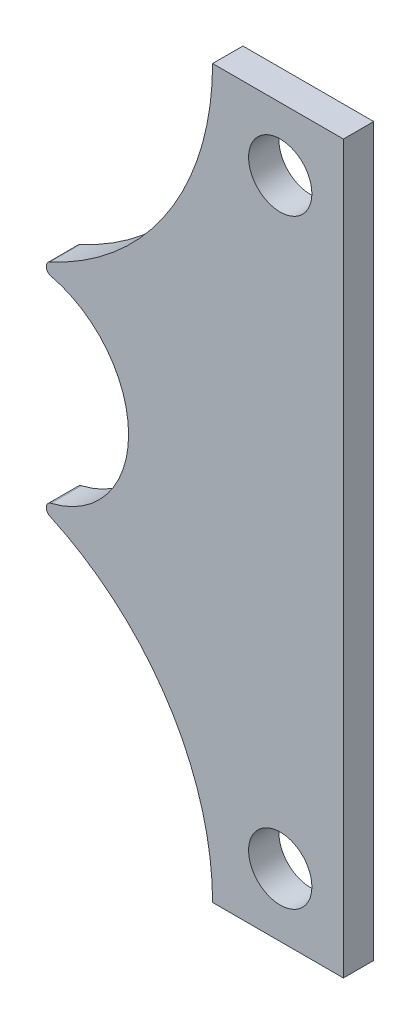
ISO-10303-21;
HEADER;
FILE_DESCRIPTION(('STEP AP214'),'2;1');
FILE_NAME('part.step','',(''),(''),'','','');
FILE_SCHEMA(('AUTOMOTIVE_DESIGN { 1 0 10303 214 1 1 1 1 }'));
ENDSEC;
DATA;
#1=APPLICATION_CONTEXT('core data for automotive mechanical design processes');
#2=APPLICATION_PROTOCOL_DEFINITION('international standard','automotive_design',2000,#1);
#3=PRODUCT_CONTEXT('',#1,'mechanical');
#4=PRODUCT('Part','Part','',(#3));
#5=PRODUCT_RELATED_PRODUCT_CATEGORY('part','',(#4));
#6=PRODUCT_DEFINITION_FORMATION('','',#4);
#7=PRODUCT_DEFINITION_CONTEXT('part definition',#1,'design');
#8=PRODUCT_DEFINITION('design','',#6,#7);
#9=PRODUCT_DEFINITION_SHAPE('','',#8);
#10=(LENGTH_UNIT() NAMED_UNIT(*) SI_UNIT(.MILLI.,.METRE.));
#11=(NAMED_UNIT(*) PLANE_ANGLE_UNIT() SI_UNIT($,.RADIAN.));
#12=(NAMED_UNIT(*) SI_UNIT($,.STERADIAN.) SOLID_ANGLE_UNIT());
#13=UNCERTAINTY_MEASURE_WITH_UNIT(LENGTH_MEASURE(1.E-05),#10,'distance_accuracy_value','');
#14=(GEOMETRIC_REPRESENTATION_CONTEXT(3) GLOBAL_UNCERTAINTY_ASSIGNED_CONTEXT((#13)) GLOBAL_UNIT_ASSIGNED_CONTEXT((#10,
#11,#12)) REPRESENTATION_CONTEXT('',''));
#15=CARTESIAN_POINT('',(0.,0.,0.));
#16=DIRECTION('',(0.,0.,1.));
#17=DIRECTION('',(1.,0.,0.));
#18=AXIS2_PLACEMENT_3D('',#15,#16,#17);
#19=CARTESIAN_POINT('',(-63.1804076074481,-73.025,3.048));
#20=DIRECTION('',(0.,0.,-1.));
#21=DIRECTION('',(-1.,0.,0.));
#22=AXIS2_PLACEMENT_3D('',#19,#20,#21);
#23=CYLINDRICAL_SURFACE('',#22,55.9342935428807);
#24=CARTESIAN_POINT('',(-63.1804076074481,-73.025,3.048));
#25=DIRECTION('',(0.,0.,1.));
#26=DIRECTION('',(1.,0.,0.));
#27=AXIS2_PLACEMENT_3D('',#24,#25,#26);
#28=CIRCLE('',#27,55.9342935428807);
#29=CARTESIAN_POINT('',(-7.24611406456736,-73.025,3.048));
#30=VERTEX_POINT('',#29);
#31=CARTESIAN_POINT('',(-39.9374523846132,-22.148578873407,3.048));
#32=VERTEX_POINT('',#31);
#33=EDGE_CURVE('E106',#30,#32,#28,.T.);
#34=ORIENTED_EDGE('',*,*,#33,.T.);
#35=DIRECTION('',(0.,0.,-1.));
#36=VECTOR('',#35,1.);
#37=CARTESIAN_POINT('',(-39.9374523846132,-22.148578873407,3.048));
#38=LINE('',#37,#36);
#39=CARTESIAN_POINT('',(-39.9374523846132,-22.148578873407,-3.048));
#40=VERTEX_POINT('',#39);
#41=EDGE_CURVE('E112',#32,#40,#38,.T.);
#42=ORIENTED_EDGE('',*,*,#41,.T.);
#43=CARTESIAN_POINT('',(-63.1804076074481,-73.025,-3.048));
#44=DIRECTION('',(0.,0.,1.));
#45=DIRECTION('',(1.,0.,0.));
#46=AXIS2_PLACEMENT_3D('',#43,#44,#45);
#47=CIRCLE('',#46,55.9342935428807);
#48=CARTESIAN_POINT('',(-7.24611406456736,-73.025,-3.048));
#49=VERTEX_POINT('',#48);
#50=EDGE_CURVE('E109',#49,#40,#47,.T.);
#51=ORIENTED_EDGE('',*,*,#50,.F.);
#52=DIRECTION('',(0.,0.,-1.));
#53=VECTOR('',#52,1.);
#54=CARTESIAN_POINT('',(-7.24611406456736,-73.025,3.048));
#55=LINE('',#54,#53);
#56=EDGE_CURVE('E102',#30,#49,#55,.T.);
#57=ORIENTED_EDGE('',*,*,#56,.F.);
#58=EDGE_LOOP('',(#34,#42,#51,#57));
#59=FACE_BOUND('',#58,.T.);
#60=ADVANCED_FACE('F36',(#59),#23,.F.);
#61=CARTESIAN_POINT('',(0.,-73.025,3.048));
#62=DIRECTION('',(0.,1.,0.));
#63=DIRECTION('',(0.,0.,1.));
#64=AXIS2_PLACEMENT_3D('',#61,#62,#63);
#65=PLANE('',#64);
#66=DIRECTION('',(1.,0.,0.));
#67=VECTOR('',#66,1.);
#68=CARTESIAN_POINT('',(0.,-73.025,-3.048));
#69=LINE('',#68,#67);
#70=CARTESIAN_POINT('',(19.05,-73.025,-3.048));
#71=VERTEX_POINT('',#70);
#72=EDGE_CURVE('E147',#49,#71,#69,.T.);
#73=ORIENTED_EDGE('',*,*,#72,.T.);
#74=DIRECTION('',(0.,0.,-1.));
#75=VECTOR('',#74,1.);
#76=CARTESIAN_POINT('',(19.05,-73.025,3.048));
#77=LINE('',#76,#75);
#78=CARTESIAN_POINT('',(19.05,-73.025,3.048));
#79=VERTEX_POINT('',#78);
#80=EDGE_CURVE('E113',#79,#71,#77,.T.);
#81=ORIENTED_EDGE('',*,*,#80,.F.);
#82=DIRECTION('',(1.,0.,0.));
#83=VECTOR('',#82,1.);
#84=CARTESIAN_POINT('',(0.,-73.025,3.048));
#85=LINE('',#84,#83);
#86=EDGE_CURVE('E116',#30,#79,#85,.T.);
#87=ORIENTED_EDGE('',*,*,#86,.F.);
#88=ORIENTED_EDGE('',*,*,#56,.T.);
#89=EDGE_LOOP('',(#73,#81,#87,#88));
#90=FACE_BOUND('',#89,.T.);
#91=ADVANCED_FACE('F117',(#90),#65,.F.);
#92=CARTESIAN_POINT('',(19.05,0.,3.048));
#93=DIRECTION('',(-1.,0.,0.));
#94=DIRECTION('',(0.,0.,1.));
#95=AXIS2_PLACEMENT_3D('',#92,#93,#94);
#96=PLANE('',#95);
#97=DIRECTION('',(0.,1.,0.));
#98=VECTOR('',#97,1.);
#99=CARTESIAN_POINT('',(19.05,0.,-3.048));
#100=LINE('',#99,#98);
#101=CARTESIAN_POINT('',(19.05,73.025,-3.048));
#102=VERTEX_POINT('',#101);
#103=EDGE_CURVE('E149',#71,#102,#100,.T.);
#104=ORIENTED_EDGE('',*,*,#103,.T.);
#105=DIRECTION('',(0.,0.,-1.));
#106=VECTOR('',#105,1.);
#107=CARTESIAN_POINT('',(19.05,73.025,3.048));
#108=LINE('',#107,#106);
#109=CARTESIAN_POINT('',(19.05,73.025,3.048));
#110=VERTEX_POINT('',#109);
#111=EDGE_CURVE('E163',#110,#102,#108,.T.);
#112=ORIENTED_EDGE('',*,*,#111,.F.);
#113=DIRECTION('',(0.,1.,0.));
#114=VECTOR('',#113,1.);
#115=CARTESIAN_POINT('',(19.05,0.,3.048));
#116=LINE('',#115,#114);
#117=EDGE_CURVE('E120',#79,#110,#116,.T.);
#118=ORIENTED_EDGE('',*,*,#117,.F.);
#119=ORIENTED_EDGE('',*,*,#80,.T.);
#120=EDGE_LOOP('',(#104,#112,#118,#119));
#121=FACE_BOUND('',#120,.T.);
#122=ADVANCED_FACE('F188',(#121),#96,.F.);
#123=CARTESIAN_POINT('',(0.,73.025,3.048));
#124=DIRECTION('',(0.,1.,0.));
#125=DIRECTION('',(0.,0.,1.));
#126=AXIS2_PLACEMENT_3D('',#123,#124,#125);
#127=PLANE('',#126);
#128=DIRECTION('',(1.,0.,0.));
#129=VECTOR('',#128,1.);
#130=CARTESIAN_POINT('',(0.,73.025,-3.048));
#131=LINE('',#130,#129);
#132=CARTESIAN_POINT('',(-7.24611406456736,73.025,-3.048));
#133=VERTEX_POINT('',#132);
#134=EDGE_CURVE('E152',#133,#102,#131,.T.);
#135=ORIENTED_EDGE('',*,*,#134,.F.);
#136=DIRECTION('',(0.,0.,-1.));
#137=VECTOR('',#136,1.);
#138=CARTESIAN_POINT('',(-7.24611406456736,73.025,3.048));
#139=LINE('',#138,#137);
#140=CARTESIAN_POINT('',(-7.24611406456736,73.025,3.048));
#141=VERTEX_POINT('',#140);
#142=EDGE_CURVE('E145',#141,#133,#139,.T.);
#143=ORIENTED_EDGE('',*,*,#142,.F.);
#144=DIRECTION('',(1.,0.,0.));
#145=VECTOR('',#144,1.);
#146=CARTESIAN_POINT('',(0.,73.025,3.048));
#147=LINE('',#146,#145);
#148=EDGE_CURVE('E132',#141,#110,#147,.T.);
#149=ORIENTED_EDGE('',*,*,#148,.T.);
#150=ORIENTED_EDGE('',*,*,#111,.T.);
#151=EDGE_LOOP('',(#135,#143,#149,#150));
#152=FACE_BOUND('',#151,.T.);
#153=ADVANCED_FACE('F193',(#152),#127,.T.);
#154=CARTESIAN_POINT('',(-63.1804076074481,73.025,3.048));
#155=DIRECTION('',(0.,0.,-1.));
#156=DIRECTION('',(-1.,0.,0.));
#157=AXIS2_PLACEMENT_3D('',#154,#155,#156);
#158=CYLINDRICAL_SURFACE('',#157,55.9342935428807);
#159=CARTESIAN_POINT('',(-63.1804076074481,73.025,-3.048));
#160=DIRECTION('',(0.,0.,1.));
#161=DIRECTION('',(1.,0.,0.));
#162=AXIS2_PLACEMENT_3D('',#159,#160,#161);
#163=CIRCLE('',#162,55.9342935428807);
#164=CARTESIAN_POINT('',(-39.9374523846132,22.148578873407,-3.048));
#165=VERTEX_POINT('',#164);
#166=EDGE_CURVE('E155',#133,#165,#163,.F.);
#167=ORIENTED_EDGE('',*,*,#166,.T.);
#168=DIRECTION('',(0.,0.,-1.));
#169=VECTOR('',#168,1.);
#170=CARTESIAN_POINT('',(-39.9374523846132,22.148578873407,3.048));
#171=LINE('',#170,#169);
#172=CARTESIAN_POINT('',(-39.9374523846132,22.148578873407,3.048));
#173=VERTEX_POINT('',#172);
#174=EDGE_CURVE('E11',#165,#173,#171,.F.);
#175=ORIENTED_EDGE('',*,*,#174,.T.);
#176=CARTESIAN_POINT('',(-63.1804076074481,73.025,3.048));
#177=DIRECTION('',(0.,0.,1.));
#178=DIRECTION('',(1.,0.,0.));
#179=AXIS2_PLACEMENT_3D('',#176,#177,#178);
#180=CIRCLE('',#179,55.9342935428807);
#181=EDGE_CURVE('E135',#141,#173,#180,.F.);
#182=ORIENTED_EDGE('',*,*,#181,.F.);
#183=ORIENTED_EDGE('',*,*,#142,.T.);
#184=EDGE_LOOP('',(#167,#175,#182,#183));
#185=FACE_BOUND('',#184,.T.);
#186=ADVANCED_FACE('F195',(#185),#158,.F.);
#187=CARTESIAN_POINT('',(6.35,-60.325,3.048));
#188=DIRECTION('',(0.,0.,-1.));
#189=DIRECTION('',(-1.,0.,0.));
#190=AXIS2_PLACEMENT_3D('',#187,#188,#189);
#191=CYLINDRICAL_SURFACE('',#190,6.3627);
#192=CARTESIAN_POINT('',(6.35,-60.325,3.048));
#193=DIRECTION('',(0.,0.,1.));
#194=DIRECTION('',(1.,0.,0.));
#195=AXIS2_PLACEMENT_3D('',#192,#193,#194);
#196=CIRCLE('',#195,6.3627);
#197=CARTESIAN_POINT('',(12.7127,-60.325,3.048));
#198=VERTEX_POINT('',#197);
#199=EDGE_CURVE('E139',#198,#198,#196,.T.);
#200=ORIENTED_EDGE('',*,*,#199,.T.);
#201=EDGE_LOOP('',(#200));
#202=FACE_BOUND('',#201,.T.);
#203=CARTESIAN_POINT('',(6.35,-60.325,-3.048));
#204=DIRECTION('',(0.,0.,1.));
#205=DIRECTION('',(1.,0.,0.));
#206=AXIS2_PLACEMENT_3D('',#203,#204,#205);
#207=CIRCLE('',#206,6.3627);
#208=CARTESIAN_POINT('',(12.7127,-60.325,-3.048));
#209=VERTEX_POINT('',#208);
#210=EDGE_CURVE('E128',#209,#209,#207,.T.);
#211=ORIENTED_EDGE('',*,*,#210,.F.);
#212=EDGE_LOOP('',(#211));
#213=FACE_BOUND('',#212,.T.);
#214=ADVANCED_FACE('F197',(#202,#213),#191,.F.);
#215=CARTESIAN_POINT('',(-44.45,0.,3.048));
#216=DIRECTION('',(0.,0.,-1.));
#217=DIRECTION('',(-1.,0.,0.));
#218=AXIS2_PLACEMENT_3D('',#215,#216,#217);
#219=CYLINDRICAL_SURFACE('',#218,20.32);
#220=CARTESIAN_POINT('',(-44.45,0.,-3.048));
#221=DIRECTION('',(0.,0.,1.));
#222=DIRECTION('',(1.,0.,0.));
#223=AXIS2_PLACEMENT_3D('',#220,#221,#222);
#224=CIRCLE('',#223,20.32);
#225=CARTESIAN_POINT('',(-39.7062034407975,-19.7585119430816,-3.048));
#226=VERTEX_POINT('',#225);
#227=CARTESIAN_POINT('',(-39.7062034407975,19.7585119430816,-3.048));
#228=VERTEX_POINT('',#227);
#229=EDGE_CURVE('E157',#226,#228,#224,.T.);
#230=ORIENTED_EDGE('',*,*,#229,.F.);
#231=DIRECTION('',(0.,0.,-1.));
#232=VECTOR('',#231,1.);
#233=CARTESIAN_POINT('',(-39.7062034407975,-19.7585119430816,3.048));
#234=LINE('',#233,#232);
#235=CARTESIAN_POINT('',(-39.7062034407975,-19.7585119430816,3.048));
#236=VERTEX_POINT('',#235);
#237=EDGE_CURVE('E174',#226,#236,#234,.F.);
#238=ORIENTED_EDGE('',*,*,#237,.T.);
#239=CARTESIAN_POINT('',(-44.45,0.,3.048));
#240=DIRECTION('',(0.,0.,1.));
#241=DIRECTION('',(1.,0.,0.));
#242=AXIS2_PLACEMENT_3D('',#239,#240,#241);
#243=CIRCLE('',#242,20.32);
#244=CARTESIAN_POINT('',(-39.7062034407975,19.7585119430816,3.048));
#245=VERTEX_POINT('',#244);
#246=EDGE_CURVE('E137',#236,#245,#243,.T.);
#247=ORIENTED_EDGE('',*,*,#246,.T.);
#248=DIRECTION('',(0.,0.,-1.));
#249=VECTOR('',#248,1.);
#250=CARTESIAN_POINT('',(-39.7062034407975,19.7585119430816,3.048));
#251=LINE('',#250,#249);
#252=EDGE_CURVE('E171',#245,#228,#251,.T.);
#253=ORIENTED_EDGE('',*,*,#252,.T.);
#254=EDGE_LOOP('',(#230,#238,#247,#253));
#255=FACE_BOUND('',#254,.T.);
#256=ADVANCED_FACE('F179',(#255),#219,.F.);
#257=CARTESIAN_POINT('',(6.35,60.325,3.048));
#258=DIRECTION('',(0.,0.,-1.));
#259=DIRECTION('',(-1.,0.,0.));
#260=AXIS2_PLACEMENT_3D('',#257,#258,#259);
#261=CYLINDRICAL_SURFACE('',#260,6.3627);
#262=CARTESIAN_POINT('',(6.35,60.325,3.048));
#263=DIRECTION('',(0.,0.,1.));
#264=DIRECTION('',(1.,0.,0.));
#265=AXIS2_PLACEMENT_3D('',#262,#263,#264);
#266=CIRCLE('',#265,6.3627);
#267=CARTESIAN_POINT('',(12.7127,60.325,3.048));
#268=VERTEX_POINT('',#267);
#269=EDGE_CURVE('E142',#268,#268,#266,.T.);
#270=ORIENTED_EDGE('',*,*,#269,.T.);
#271=EDGE_LOOP('',(#270));
#272=FACE_BOUND('',#271,.T.);
#273=CARTESIAN_POINT('',(6.35,60.325,-3.048));
#274=DIRECTION('',(0.,0.,1.));
#275=DIRECTION('',(1.,0.,0.));
#276=AXIS2_PLACEMENT_3D('',#273,#274,#275);
#277=CIRCLE('',#276,6.3627);
#278=CARTESIAN_POINT('',(12.7127,60.325,-3.048));
#279=VERTEX_POINT('',#278);
#280=EDGE_CURVE('E125',#279,#279,#277,.T.);
#281=ORIENTED_EDGE('',*,*,#280,.F.);
#282=EDGE_LOOP('',(#281));
#283=FACE_BOUND('',#282,.T.);
#284=ADVANCED_FACE('F224',(#272,#283),#261,.F.);
#285=CARTESIAN_POINT('',(0.,0.,3.048));
#286=DIRECTION('',(0.,0.,1.));
#287=DIRECTION('',(1.,0.,0.));
#288=AXIS2_PLACEMENT_3D('',#285,#286,#287);
#289=PLANE('',#288);
#290=ORIENTED_EDGE('',*,*,#246,.F.);
#291=CARTESIAN_POINT('',(-39.4097161558473,-20.9934189395242,3.048));
#292=DIRECTION('',(0.,0.,1.));
#293=DIRECTION('',(1.,0.,0.));
#294=AXIS2_PLACEMENT_3D('',#291,#292,#293);
#295=CIRCLE('',#294,1.27);
#296=EDGE_CURVE('E44',#236,#32,#295,.T.);
#297=ORIENTED_EDGE('',*,*,#296,.T.);
#298=ORIENTED_EDGE('',*,*,#33,.F.);
#299=ORIENTED_EDGE('',*,*,#86,.T.);
#300=ORIENTED_EDGE('',*,*,#117,.T.);
#301=ORIENTED_EDGE('',*,*,#148,.F.);
#302=ORIENTED_EDGE('',*,*,#181,.T.);
#303=CARTESIAN_POINT('',(-39.4097161558473,20.9934189395242,3.048));
#304=DIRECTION('',(0.,0.,1.));
#305=DIRECTION('',(1.,0.,0.));
#306=AXIS2_PLACEMENT_3D('',#303,#304,#305);
#307=CIRCLE('',#306,1.27);
#308=EDGE_CURVE('E56',#173,#245,#307,.T.);
#309=ORIENTED_EDGE('',*,*,#308,.T.);
#310=EDGE_LOOP('',(#290,#297,#298,#299,#300,#301,#302,#309));
#311=FACE_BOUND('',#310,.T.);
#312=ORIENTED_EDGE('',*,*,#199,.F.);
#313=EDGE_LOOP('',(#312));
#314=FACE_BOUND('',#313,.T.);
#315=ORIENTED_EDGE('',*,*,#269,.F.);
#316=EDGE_LOOP('',(#315));
#317=FACE_BOUND('',#316,.T.);
#318=ADVANCED_FACE('F122',(#311,#314,#317),#289,.T.);
#319=CARTESIAN_POINT('',(0.,0.,-3.048));
#320=DIRECTION('',(0.,0.,1.));
#321=DIRECTION('',(1.,0.,0.));
#322=AXIS2_PLACEMENT_3D('',#319,#320,#321);
#323=PLANE('',#322);
#324=ORIENTED_EDGE('',*,*,#50,.T.);
#325=CARTESIAN_POINT('',(-39.4097161558473,-20.9934189395242,-3.048));
#326=DIRECTION('',(0.,0.,1.));
#327=DIRECTION('',(1.,0.,0.));
#328=AXIS2_PLACEMENT_3D('',#325,#326,#327);
#329=CIRCLE('',#328,1.27);
#330=EDGE_CURVE('E169',#40,#226,#329,.F.);
#331=ORIENTED_EDGE('',*,*,#330,.T.);
#332=ORIENTED_EDGE('',*,*,#229,.T.);
#333=CARTESIAN_POINT('',(-39.4097161558473,20.9934189395242,-3.048));
#334=DIRECTION('',(0.,0.,1.));
#335=DIRECTION('',(1.,0.,0.));
#336=AXIS2_PLACEMENT_3D('',#333,#334,#335);
#337=CIRCLE('',#336,1.27);
#338=EDGE_CURVE('E167',#228,#165,#337,.F.);
#339=ORIENTED_EDGE('',*,*,#338,.T.);
#340=ORIENTED_EDGE('',*,*,#166,.F.);
#341=ORIENTED_EDGE('',*,*,#134,.T.);
#342=ORIENTED_EDGE('',*,*,#103,.F.);
#343=ORIENTED_EDGE('',*,*,#72,.F.);
#344=EDGE_LOOP('',(#324,#331,#332,#339,#340,#341,#342,#343));
#345=FACE_BOUND('',#344,.T.);
#346=ORIENTED_EDGE('',*,*,#210,.T.);
#347=EDGE_LOOP('',(#346));
#348=FACE_BOUND('',#347,.T.);
#349=ORIENTED_EDGE('',*,*,#280,.T.);
#350=EDGE_LOOP('',(#349));
#351=FACE_BOUND('',#350,.T.);
#352=ADVANCED_FACE('F184',(#345,#348,#351),#323,.F.);
#353=CARTESIAN_POINT('',(-39.4097161558473,-20.9934189395242,3.048));
#354=DIRECTION('',(0.,0.,-1.));
#355=DIRECTION('',(-1.,0.,0.));
#356=AXIS2_PLACEMENT_3D('',#353,#354,#355);
#357=CYLINDRICAL_SURFACE('',#356,1.27);
#358=ORIENTED_EDGE('',*,*,#296,.F.);
#359=ORIENTED_EDGE('',*,*,#237,.F.);
#360=ORIENTED_EDGE('',*,*,#330,.F.);
#361=ORIENTED_EDGE('',*,*,#41,.F.);
#362=EDGE_LOOP('',(#358,#359,#360,#361));
#363=FACE_BOUND('',#362,.T.);
#364=ADVANCED_FACE('F182',(#363),#357,.T.);
#365=CARTESIAN_POINT('',(-39.4097161558473,20.9934189395242,3.048));
#366=DIRECTION('',(0.,0.,-1.));
#367=DIRECTION('',(-1.,0.,0.));
#368=AXIS2_PLACEMENT_3D('',#365,#366,#367);
#369=CYLINDRICAL_SURFACE('',#368,1.27);
#370=ORIENTED_EDGE('',*,*,#308,.F.);
#371=ORIENTED_EDGE('',*,*,#174,.F.);
#372=ORIENTED_EDGE('',*,*,#338,.F.);
#373=ORIENTED_EDGE('',*,*,#252,.F.);
#374=EDGE_LOOP('',(#370,#371,#372,#373));
#375=FACE_BOUND('',#374,.T.);
#376=ADVANCED_FACE('F38',(#375),#369,.T.);
#377=CLOSED_SHELL('',(#60,#91,#122,#153,#186,#214,#256,#284,#318,#352,#364,#376));
#378=MANIFOLD_SOLID_BREP('B2',#377);
#379=ADVANCED_BREP_SHAPE_REPRESENTATION('',(#18,#378),#14);
#380=SHAPE_DEFINITION_REPRESENTATION(#9,#379);
ENDSEC;
END-ISO-10303-21;
